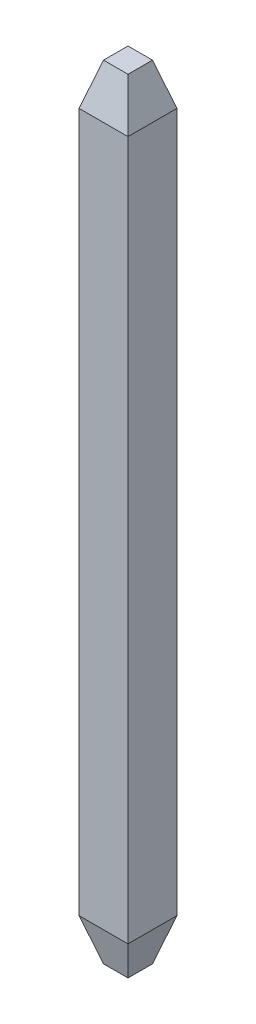
ISO-10303-21;
HEADER;
FILE_DESCRIPTION(('STEP AP214'),'2;1');
FILE_NAME('part.step','',(''),(''),'','','');
FILE_SCHEMA(('AUTOMOTIVE_DESIGN { 1 0 10303 214 1 1 1 1 }'));
ENDSEC;
DATA;
#1=APPLICATION_CONTEXT('core data for automotive mechanical design processes');
#2=APPLICATION_PROTOCOL_DEFINITION('international standard','automotive_design',2000,#1);
#3=PRODUCT_CONTEXT('',#1,'mechanical');
#4=PRODUCT('Part','Part','',(#3));
#5=PRODUCT_RELATED_PRODUCT_CATEGORY('part','',(#4));
#6=PRODUCT_DEFINITION_FORMATION('','',#4);
#7=PRODUCT_DEFINITION_CONTEXT('part definition',#1,'design');
#8=PRODUCT_DEFINITION('design','',#6,#7);
#9=PRODUCT_DEFINITION_SHAPE('','',#8);
#10=(LENGTH_UNIT() NAMED_UNIT(*) SI_UNIT(.MILLI.,.METRE.));
#11=(NAMED_UNIT(*) PLANE_ANGLE_UNIT() SI_UNIT($,.RADIAN.));
#12=(NAMED_UNIT(*) SI_UNIT($,.STERADIAN.) SOLID_ANGLE_UNIT());
#13=UNCERTAINTY_MEASURE_WITH_UNIT(LENGTH_MEASURE(1.E-05),#10,'distance_accuracy_value','');
#14=(GEOMETRIC_REPRESENTATION_CONTEXT(3) GLOBAL_UNCERTAINTY_ASSIGNED_CONTEXT((#13)) GLOBAL_UNIT_ASSIGNED_CONTEXT((#10,
#11,#12)) REPRESENTATION_CONTEXT('',''));
#15=CARTESIAN_POINT('',(0.,0.,0.));
#16=DIRECTION('',(0.,0.,1.));
#17=DIRECTION('',(1.,0.,0.));
#18=AXIS2_PLACEMENT_3D('',#15,#16,#17);
#19=CARTESIAN_POINT('',(-24.289999999987,-0.965870106912721,-16.9799999999763));
#20=DIRECTION('',(-0.959644900900968,0.281214622974643,0.));
#21=DIRECTION('',(0.,0.,1.));
#22=AXIS2_PLACEMENT_3D('',#19,#20,#21);
#23=PLANE('',#22);
#24=DIRECTION('',(0.270714017147727,0.923811583516617,-0.270714017147727));
#25=VECTOR('',#24,1.);
#26=CARTESIAN_POINT('',(-24.289999999987,-0.965870106912721,-16.6599999999763));
#27=LINE('',#26,#25);
#28=CARTESIAN_POINT('',(-24.289999999987,-0.965870106912723,-16.6599999999763));
#29=VERTEX_POINT('',#28);
#30=CARTESIAN_POINT('',(-24.129999999987,-0.419870106912724,-16.8199999999763));
#31=VERTEX_POINT('',#30);
#32=EDGE_CURVE('E11',#29,#31,#27,.T.);
#33=ORIENTED_EDGE('',*,*,#32,.T.);
#34=DIRECTION('',(0.,0.,-1.));
#35=VECTOR('',#34,1.);
#36=CARTESIAN_POINT('',(-24.129999999987,-0.419870106912722,-16.8199999999763));
#37=LINE('',#36,#35);
#38=CARTESIAN_POINT('',(-24.129999999987,-0.419870106912724,-17.1399999999763));
#39=VERTEX_POINT('',#38);
#40=EDGE_CURVE('E28',#31,#39,#37,.T.);
#41=ORIENTED_EDGE('',*,*,#40,.T.);
#42=DIRECTION('',(0.270714017147727,0.923811583516617,0.270714017147727));
#43=VECTOR('',#42,1.);
#44=CARTESIAN_POINT('',(-24.289999999987,-0.965870106912721,-17.2999999999763));
#45=LINE('',#44,#43);
#46=CARTESIAN_POINT('',(-24.289999999987,-0.965870106912723,-17.2999999999763));
#47=VERTEX_POINT('',#46);
#48=EDGE_CURVE('E141',#47,#39,#45,.T.);
#49=ORIENTED_EDGE('',*,*,#48,.F.);
#50=DIRECTION('',(0.,0.,-1.));
#51=VECTOR('',#50,1.);
#52=CARTESIAN_POINT('',(-24.289999999987,-0.965870106912721,-16.6599999999763));
#53=LINE('',#52,#51);
#54=EDGE_CURVE('E170',#29,#47,#53,.T.);
#55=ORIENTED_EDGE('',*,*,#54,.F.);
#56=EDGE_LOOP('',(#33,#41,#49,#55));
#57=FACE_BOUND('',#56,.T.);
#58=ADVANCED_FACE('F17',(#57),#23,.T.);
#59=CARTESIAN_POINT('',(-23.969999999987,-0.965870106912721,-16.6599999999763));
#60=DIRECTION('',(0.,0.281214622974643,0.959644900900968));
#61=DIRECTION('',(1.,0.,0.));
#62=AXIS2_PLACEMENT_3D('',#59,#60,#61);
#63=PLANE('',#62);
#64=DIRECTION('',(-0.270714017147727,0.923811583516617,-0.270714017147727));
#65=VECTOR('',#64,1.);
#66=CARTESIAN_POINT('',(-23.649999999987,-0.965870106912721,-16.6599999999763));
#67=LINE('',#66,#65);
#68=CARTESIAN_POINT('',(-23.649999999987,-0.965870106912723,-16.6599999999763));
#69=VERTEX_POINT('',#68);
#70=CARTESIAN_POINT('',(-23.809999999987,-0.419870106912724,-16.8199999999763));
#71=VERTEX_POINT('',#70);
#72=EDGE_CURVE('E154',#69,#71,#67,.T.);
#73=ORIENTED_EDGE('',*,*,#72,.T.);
#74=DIRECTION('',(-1.,0.,0.));
#75=VECTOR('',#74,1.);
#76=CARTESIAN_POINT('',(-23.809999999987,-0.419870106912722,-16.8199999999763));
#77=LINE('',#76,#75);
#78=EDGE_CURVE('E146',#71,#31,#77,.T.);
#79=ORIENTED_EDGE('',*,*,#78,.T.);
#80=ORIENTED_EDGE('',*,*,#32,.F.);
#81=DIRECTION('',(-1.,0.,0.));
#82=VECTOR('',#81,1.);
#83=CARTESIAN_POINT('',(-23.649999999987,-0.965870106912721,-16.6599999999763));
#84=LINE('',#83,#82);
#85=EDGE_CURVE('E173',#69,#29,#84,.T.);
#86=ORIENTED_EDGE('',*,*,#85,.F.);
#87=EDGE_LOOP('',(#73,#79,#80,#86));
#88=FACE_BOUND('',#87,.T.);
#89=ADVANCED_FACE('F280',(#88),#63,.T.);
#90=CARTESIAN_POINT('',(-23.649999999987,-0.965870106912721,-16.9799999999763));
#91=DIRECTION('',(0.959644900900968,0.281214622974643,0.));
#92=DIRECTION('',(0.,0.,-1.));
#93=AXIS2_PLACEMENT_3D('',#90,#91,#92);
#94=PLANE('',#93);
#95=DIRECTION('',(-0.270714017147727,0.923811583516617,0.270714017147727));
#96=VECTOR('',#95,1.);
#97=CARTESIAN_POINT('',(-23.649999999987,-0.965870106912721,-17.2999999999763));
#98=LINE('',#97,#96);
#99=CARTESIAN_POINT('',(-23.649999999987,-0.965870106912723,-17.2999999999763));
#100=VERTEX_POINT('',#99);
#101=CARTESIAN_POINT('',(-23.809999999987,-0.419870106912724,-17.1399999999763));
#102=VERTEX_POINT('',#101);
#103=EDGE_CURVE('E143',#100,#102,#98,.T.);
#104=ORIENTED_EDGE('',*,*,#103,.T.);
#105=DIRECTION('',(0.,0.,1.));
#106=VECTOR('',#105,1.);
#107=CARTESIAN_POINT('',(-23.809999999987,-0.419870106912722,-17.1399999999763));
#108=LINE('',#107,#106);
#109=EDGE_CURVE('E110',#102,#71,#108,.T.);
#110=ORIENTED_EDGE('',*,*,#109,.T.);
#111=ORIENTED_EDGE('',*,*,#72,.F.);
#112=DIRECTION('',(0.,0.,1.));
#113=VECTOR('',#112,1.);
#114=CARTESIAN_POINT('',(-23.649999999987,-0.965870106912721,-17.2999999999763));
#115=LINE('',#114,#113);
#116=EDGE_CURVE('E111',#100,#69,#115,.T.);
#117=ORIENTED_EDGE('',*,*,#116,.F.);
#118=EDGE_LOOP('',(#104,#110,#111,#117));
#119=FACE_BOUND('',#118,.T.);
#120=ADVANCED_FACE('F233',(#119),#94,.T.);
#121=CARTESIAN_POINT('',(-23.649999999987,-11.0738701069127,-16.9799999999763));
#122=DIRECTION('',(1.,0.,0.));
#123=DIRECTION('',(0.,1.,0.));
#124=AXIS2_PLACEMENT_3D('',#121,#122,#123);
#125=PLANE('',#124);
#126=DIRECTION('',(0.,1.,0.));
#127=VECTOR('',#126,1.);
#128=CARTESIAN_POINT('',(-23.649999999987,-10.1039999999832,-16.6599999999763));
#129=LINE('',#128,#127);
#130=CARTESIAN_POINT('',(-23.649999999987,-10.1039999999832,-16.6599999999763));
#131=VERTEX_POINT('',#130);
#132=EDGE_CURVE('E72',#131,#69,#129,.T.);
#133=ORIENTED_EDGE('',*,*,#132,.F.);
#134=DIRECTION('',(0.,0.,1.));
#135=VECTOR('',#134,1.);
#136=CARTESIAN_POINT('',(-23.649999999987,-10.1039999999832,-17.2999999999763));
#137=LINE('',#136,#135);
#138=CARTESIAN_POINT('',(-23.649999999987,-10.1039999999832,-17.2999999999763));
#139=VERTEX_POINT('',#138);
#140=EDGE_CURVE('E77',#139,#131,#137,.T.);
#141=ORIENTED_EDGE('',*,*,#140,.F.);
#142=DIRECTION('',(0.,1.,0.));
#143=VECTOR('',#142,1.);
#144=CARTESIAN_POINT('',(-23.649999999987,-10.1039999999832,-17.2999999999763));
#145=LINE('',#144,#143);
#146=EDGE_CURVE('E81',#139,#100,#145,.T.);
#147=ORIENTED_EDGE('',*,*,#146,.T.);
#148=ORIENTED_EDGE('',*,*,#116,.T.);
#149=EDGE_LOOP('',(#133,#141,#147,#148));
#150=FACE_BOUND('',#149,.T.);
#151=ADVANCED_FACE('F79',(#150),#125,.T.);
#152=CARTESIAN_POINT('',(-23.648999999987,-5.53443505344796,-17.2999999999763));
#153=DIRECTION('',(0.,0.,-1.));
#154=DIRECTION('',(0.,-1.,0.));
#155=AXIS2_PLACEMENT_3D('',#152,#153,#154);
#156=PLANE('',#155);
#157=ORIENTED_EDGE('',*,*,#146,.F.);
#158=DIRECTION('',(1.,0.,0.));
#159=VECTOR('',#158,1.);
#160=CARTESIAN_POINT('',(-24.289999999987,-10.1039999999832,-17.2999999999763));
#161=LINE('',#160,#159);
#162=CARTESIAN_POINT('',(-24.289999999987,-10.1039999999832,-17.2999999999763));
#163=VERTEX_POINT('',#162);
#164=EDGE_CURVE('E94',#163,#139,#161,.T.);
#165=ORIENTED_EDGE('',*,*,#164,.F.);
#166=DIRECTION('',(0.,1.,0.));
#167=VECTOR('',#166,1.);
#168=CARTESIAN_POINT('',(-24.289999999987,-10.1039999999832,-17.2999999999763));
#169=LINE('',#168,#167);
#170=EDGE_CURVE('E184',#163,#47,#169,.T.);
#171=ORIENTED_EDGE('',*,*,#170,.T.);
#172=DIRECTION('',(1.,0.,0.));
#173=VECTOR('',#172,1.);
#174=CARTESIAN_POINT('',(-24.289999999987,-0.965870106912721,-17.2999999999763));
#175=LINE('',#174,#173);
#176=EDGE_CURVE('E105',#47,#100,#175,.T.);
#177=ORIENTED_EDGE('',*,*,#176,.T.);
#178=EDGE_LOOP('',(#157,#165,#171,#177));
#179=FACE_BOUND('',#178,.T.);
#180=ADVANCED_FACE('F107',(#179),#156,.T.);
#181=CARTESIAN_POINT('',(-23.969999999987,-10.1039999999832,-17.2999999999763));
#182=DIRECTION('',(0.,-0.281214622974643,-0.959644900900968));
#183=DIRECTION('',(0.,-0.959644900900968,0.281214622974643));
#184=AXIS2_PLACEMENT_3D('',#181,#182,#183);
#185=PLANE('',#184);
#186=ORIENTED_EDGE('',*,*,#164,.T.);
#187=DIRECTION('',(-0.270714017147727,-0.923811583516618,0.270714017147727));
#188=VECTOR('',#187,1.);
#189=CARTESIAN_POINT('',(-23.649999999987,-10.1039999999832,-17.2999999999763));
#190=LINE('',#189,#188);
#191=CARTESIAN_POINT('',(-23.809999999987,-10.6499999999832,-17.1399999999763));
#192=VERTEX_POINT('',#191);
#193=EDGE_CURVE('E97',#139,#192,#190,.T.);
#194=ORIENTED_EDGE('',*,*,#193,.T.);
#195=DIRECTION('',(1.,0.,0.));
#196=VECTOR('',#195,1.);
#197=CARTESIAN_POINT('',(-24.129999999987,-10.6499999999832,-17.1399999999763));
#198=LINE('',#197,#196);
#199=CARTESIAN_POINT('',(-24.129999999987,-10.6499999999832,-17.1399999999763));
#200=VERTEX_POINT('',#199);
#201=EDGE_CURVE('E88',#200,#192,#198,.T.);
#202=ORIENTED_EDGE('',*,*,#201,.F.);
#203=DIRECTION('',(0.270714017147727,-0.923811583516618,0.270714017147727));
#204=VECTOR('',#203,1.);
#205=CARTESIAN_POINT('',(-24.289999999987,-10.1039999999832,-17.2999999999763));
#206=LINE('',#205,#204);
#207=EDGE_CURVE('E100',#163,#200,#206,.T.);
#208=ORIENTED_EDGE('',*,*,#207,.F.);
#209=EDGE_LOOP('',(#186,#194,#202,#208));
#210=FACE_BOUND('',#209,.T.);
#211=ADVANCED_FACE('F95',(#210),#185,.T.);
#212=CARTESIAN_POINT('',(-24.289999999987,-10.1039999999832,-16.9799999999763));
#213=DIRECTION('',(-0.959644900900968,-0.281214622974643,0.));
#214=DIRECTION('',(-0.281214622974643,0.959644900900968,0.));
#215=AXIS2_PLACEMENT_3D('',#212,#213,#214);
#216=PLANE('',#215);
#217=DIRECTION('',(0.,0.,-1.));
#218=VECTOR('',#217,1.);
#219=CARTESIAN_POINT('',(-24.289999999987,-10.1039999999832,-16.6599999999763));
#220=LINE('',#219,#218);
#221=CARTESIAN_POINT('',(-24.289999999987,-10.1039999999832,-16.6599999999763));
#222=VERTEX_POINT('',#221);
#223=EDGE_CURVE('E117',#222,#163,#220,.T.);
#224=ORIENTED_EDGE('',*,*,#223,.T.);
#225=ORIENTED_EDGE('',*,*,#207,.T.);
#226=DIRECTION('',(0.,0.,-1.));
#227=VECTOR('',#226,1.);
#228=CARTESIAN_POINT('',(-24.129999999987,-10.6499999999832,-16.8199999999763));
#229=LINE('',#228,#227);
#230=CARTESIAN_POINT('',(-24.129999999987,-10.6499999999832,-16.8199999999763));
#231=VERTEX_POINT('',#230);
#232=EDGE_CURVE('E130',#231,#200,#229,.T.);
#233=ORIENTED_EDGE('',*,*,#232,.F.);
#234=DIRECTION('',(0.270714017147727,-0.923811583516618,-0.270714017147727));
#235=VECTOR('',#234,1.);
#236=CARTESIAN_POINT('',(-24.289999999987,-10.1039999999832,-16.6599999999763));
#237=LINE('',#236,#235);
#238=EDGE_CURVE('E132',#222,#231,#237,.T.);
#239=ORIENTED_EDGE('',*,*,#238,.F.);
#240=EDGE_LOOP('',(#224,#225,#233,#239));
#241=FACE_BOUND('',#240,.T.);
#242=ADVANCED_FACE('F254',(#241),#216,.T.);
#243=CARTESIAN_POINT('',(-23.969999999987,-10.1039999999832,-16.6599999999763));
#244=DIRECTION('',(0.,-0.281214622974643,0.959644900900968));
#245=DIRECTION('',(-1.,0.,0.));
#246=AXIS2_PLACEMENT_3D('',#243,#244,#245);
#247=PLANE('',#246);
#248=DIRECTION('',(-1.,0.,0.));
#249=VECTOR('',#248,1.);
#250=CARTESIAN_POINT('',(-23.649999999987,-10.1039999999832,-16.6599999999763));
#251=LINE('',#250,#249);
#252=EDGE_CURVE('E21',#131,#222,#251,.T.);
#253=ORIENTED_EDGE('',*,*,#252,.T.);
#254=ORIENTED_EDGE('',*,*,#238,.T.);
#255=DIRECTION('',(-1.,0.,0.));
#256=VECTOR('',#255,1.);
#257=CARTESIAN_POINT('',(-23.809999999987,-10.6499999999832,-16.8199999999763));
#258=LINE('',#257,#256);
#259=CARTESIAN_POINT('',(-23.809999999987,-10.6499999999832,-16.8199999999763));
#260=VERTEX_POINT('',#259);
#261=EDGE_CURVE('E165',#260,#231,#258,.T.);
#262=ORIENTED_EDGE('',*,*,#261,.F.);
#263=DIRECTION('',(-0.270714017147727,-0.923811583516618,-0.270714017147727));
#264=VECTOR('',#263,1.);
#265=CARTESIAN_POINT('',(-23.649999999987,-10.1039999999832,-16.6599999999763));
#266=LINE('',#265,#264);
#267=EDGE_CURVE('E89',#131,#260,#266,.T.);
#268=ORIENTED_EDGE('',*,*,#267,.F.);
#269=EDGE_LOOP('',(#253,#254,#262,#268));
#270=FACE_BOUND('',#269,.T.);
#271=ADVANCED_FACE('F19',(#270),#247,.T.);
#272=CARTESIAN_POINT('',(-24.130999999987,-10.6499999999832,-16.9799999999763));
#273=DIRECTION('',(0.,-1.,0.));
#274=DIRECTION('',(0.,0.,-1.));
#275=AXIS2_PLACEMENT_3D('',#272,#273,#274);
#276=PLANE('',#275);
#277=DIRECTION('',(0.,0.,1.));
#278=VECTOR('',#277,1.);
#279=CARTESIAN_POINT('',(-23.809999999987,-10.6499999999832,-17.1399999999763));
#280=LINE('',#279,#278);
#281=EDGE_CURVE('E115',#192,#260,#280,.T.);
#282=ORIENTED_EDGE('',*,*,#281,.T.);
#283=ORIENTED_EDGE('',*,*,#261,.T.);
#284=ORIENTED_EDGE('',*,*,#232,.T.);
#285=ORIENTED_EDGE('',*,*,#201,.T.);
#286=EDGE_LOOP('',(#282,#283,#284,#285));
#287=FACE_BOUND('',#286,.T.);
#288=ADVANCED_FACE('F239',(#287),#276,.T.);
#289=CARTESIAN_POINT('',(-23.649999999987,-10.1039999999832,-16.9799999999763));
#290=DIRECTION('',(0.959644900900968,-0.281214622974643,0.));
#291=DIRECTION('',(0.,0.,-1.));
#292=AXIS2_PLACEMENT_3D('',#289,#290,#291);
#293=PLANE('',#292);
#294=ORIENTED_EDGE('',*,*,#140,.T.);
#295=ORIENTED_EDGE('',*,*,#267,.T.);
#296=ORIENTED_EDGE('',*,*,#281,.F.);
#297=ORIENTED_EDGE('',*,*,#193,.F.);
#298=EDGE_LOOP('',(#294,#295,#296,#297));
#299=FACE_BOUND('',#298,.T.);
#300=ADVANCED_FACE('F113',(#299),#293,.T.);
#301=CARTESIAN_POINT('',(-24.290999999987,-5.53543505344796,-16.6599999999763));
#302=DIRECTION('',(0.,0.,1.));
#303=DIRECTION('',(1.,0.,0.));
#304=AXIS2_PLACEMENT_3D('',#301,#302,#303);
#305=PLANE('',#304);
#306=DIRECTION('',(0.,1.,0.));
#307=VECTOR('',#306,1.);
#308=CARTESIAN_POINT('',(-24.289999999987,-10.1039999999832,-16.6599999999763));
#309=LINE('',#308,#307);
#310=EDGE_CURVE('E190',#222,#29,#309,.T.);
#311=ORIENTED_EDGE('',*,*,#310,.F.);
#312=ORIENTED_EDGE('',*,*,#252,.F.);
#313=ORIENTED_EDGE('',*,*,#132,.T.);
#314=ORIENTED_EDGE('',*,*,#85,.T.);
#315=EDGE_LOOP('',(#311,#312,#313,#314));
#316=FACE_BOUND('',#315,.T.);
#317=ADVANCED_FACE('F272',(#316),#305,.T.);
#318=CARTESIAN_POINT('',(-24.289999999987,-5.53543505344796,-16.6589999999763));
#319=DIRECTION('',(-1.,0.,0.));
#320=DIRECTION('',(0.,0.,1.));
#321=AXIS2_PLACEMENT_3D('',#318,#319,#320);
#322=PLANE('',#321);
#323=ORIENTED_EDGE('',*,*,#170,.F.);
#324=ORIENTED_EDGE('',*,*,#223,.F.);
#325=ORIENTED_EDGE('',*,*,#310,.T.);
#326=ORIENTED_EDGE('',*,*,#54,.T.);
#327=EDGE_LOOP('',(#323,#324,#325,#326));
#328=FACE_BOUND('',#327,.T.);
#329=ADVANCED_FACE('F200',(#328),#322,.T.);
#330=CARTESIAN_POINT('',(-23.969999999987,-0.965870106912721,-17.2999999999763));
#331=DIRECTION('',(0.,0.281214622974643,-0.959644900900968));
#332=DIRECTION('',(-1.,0.,0.));
#333=AXIS2_PLACEMENT_3D('',#330,#331,#332);
#334=PLANE('',#333);
#335=ORIENTED_EDGE('',*,*,#48,.T.);
#336=DIRECTION('',(1.,0.,0.));
#337=VECTOR('',#336,1.);
#338=CARTESIAN_POINT('',(-24.129999999987,-0.419870106912722,-17.1399999999763));
#339=LINE('',#338,#337);
#340=EDGE_CURVE('E138',#39,#102,#339,.T.);
#341=ORIENTED_EDGE('',*,*,#340,.T.);
#342=ORIENTED_EDGE('',*,*,#103,.F.);
#343=ORIENTED_EDGE('',*,*,#176,.F.);
#344=EDGE_LOOP('',(#335,#341,#342,#343));
#345=FACE_BOUND('',#344,.T.);
#346=ADVANCED_FACE('F208',(#345),#334,.T.);
#347=CARTESIAN_POINT('',(-23.969999999987,-0.419870106912722,-17.1409999999763));
#348=DIRECTION('',(0.,1.,0.));
#349=DIRECTION('',(1.,0.,0.));
#350=AXIS2_PLACEMENT_3D('',#347,#348,#349);
#351=PLANE('',#350);
#352=ORIENTED_EDGE('',*,*,#340,.F.);
#353=ORIENTED_EDGE('',*,*,#40,.F.);
#354=ORIENTED_EDGE('',*,*,#78,.F.);
#355=ORIENTED_EDGE('',*,*,#109,.F.);
#356=EDGE_LOOP('',(#352,#353,#354,#355));
#357=FACE_BOUND('',#356,.T.);
#358=ADVANCED_FACE('F259',(#357),#351,.T.);
#359=CLOSED_SHELL('',(#58,#89,#120,#151,#180,#211,#242,#271,#288,#300,#317,#329,#346,#358));
#360=MANIFOLD_SOLID_BREP('B1',#359);
#361=ADVANCED_BREP_SHAPE_REPRESENTATION('',(#18,#360),#14);
#362=SHAPE_DEFINITION_REPRESENTATION(#9,#361);
ENDSEC;
END-ISO-10303-21;
